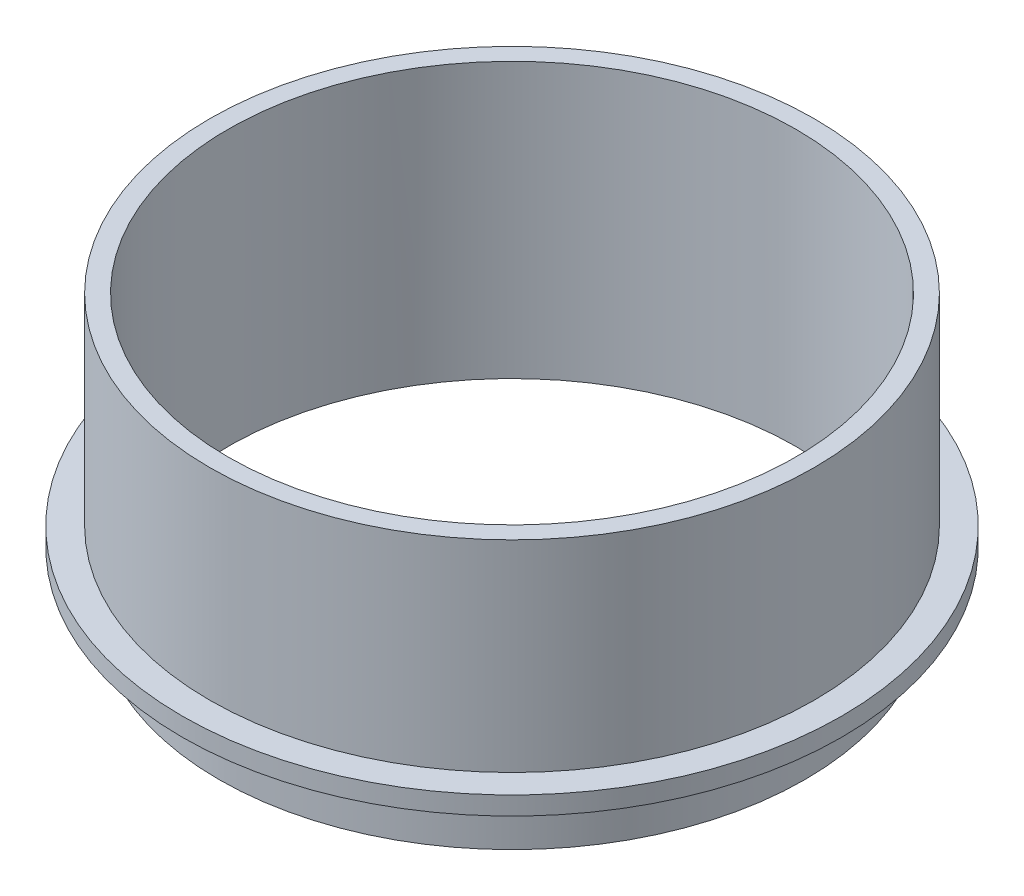
ISO-10303-21;
HEADER;
FILE_DESCRIPTION(('STEP AP214'),'2;1');
FILE_NAME('part.step','',(''),(''),'','','');
FILE_SCHEMA(('AUTOMOTIVE_DESIGN { 1 0 10303 214 1 1 1 1 }'));
ENDSEC;
DATA;
#1=APPLICATION_CONTEXT('core data for automotive mechanical design processes');
#2=APPLICATION_PROTOCOL_DEFINITION('international standard','automotive_design',2000,#1);
#3=PRODUCT_CONTEXT('',#1,'mechanical');
#4=PRODUCT('Part','Part','',(#3));
#5=PRODUCT_RELATED_PRODUCT_CATEGORY('part','',(#4));
#6=PRODUCT_DEFINITION_FORMATION('','',#4);
#7=PRODUCT_DEFINITION_CONTEXT('part definition',#1,'design');
#8=PRODUCT_DEFINITION('design','',#6,#7);
#9=PRODUCT_DEFINITION_SHAPE('','',#8);
#10=(LENGTH_UNIT() NAMED_UNIT(*) SI_UNIT(.MILLI.,.METRE.));
#11=(NAMED_UNIT(*) PLANE_ANGLE_UNIT() SI_UNIT($,.RADIAN.));
#12=(NAMED_UNIT(*) SI_UNIT($,.STERADIAN.) SOLID_ANGLE_UNIT());
#13=UNCERTAINTY_MEASURE_WITH_UNIT(LENGTH_MEASURE(1.E-05),#10,'distance_accuracy_value','');
#14=(GEOMETRIC_REPRESENTATION_CONTEXT(3) GLOBAL_UNCERTAINTY_ASSIGNED_CONTEXT((#13)) GLOBAL_UNIT_ASSIGNED_CONTEXT((#10,
#11,#12)) REPRESENTATION_CONTEXT('',''));
#15=CARTESIAN_POINT('',(0.,0.,0.));
#16=DIRECTION('',(0.,0.,1.));
#17=DIRECTION('',(1.,0.,0.));
#18=AXIS2_PLACEMENT_3D('',#15,#16,#17);
#19=CARTESIAN_POINT('',(0.,38.1,0.));
#20=DIRECTION('',(0.,-1.,0.));
#21=DIRECTION('',(0.,0.,-1.));
#22=AXIS2_PLACEMENT_3D('',#19,#20,#21);
#23=CYLINDRICAL_SURFACE('',#22,52.3875);
#24=CARTESIAN_POINT('',(0.,38.1,0.));
#25=DIRECTION('',(0.,1.,0.));
#26=DIRECTION('',(0.,0.,1.));
#27=AXIS2_PLACEMENT_3D('',#24,#25,#26);
#28=CIRCLE('',#27,52.3875);
#29=CARTESIAN_POINT('',(0.,38.1,52.3875));
#30=VERTEX_POINT('',#29);
#31=EDGE_CURVE('E43',#30,#30,#28,.T.);
#32=ORIENTED_EDGE('',*,*,#31,.F.);
#33=EDGE_LOOP('',(#32));
#34=FACE_BOUND('',#33,.T.);
#35=CARTESIAN_POINT('',(0.,3.175,0.));
#36=DIRECTION('',(0.,-1.,0.));
#37=DIRECTION('',(0.,0.,-1.));
#38=AXIS2_PLACEMENT_3D('',#35,#36,#37);
#39=CIRCLE('',#38,52.3875);
#40=CARTESIAN_POINT('',(0.,3.175,-52.3875));
#41=VERTEX_POINT('',#40);
#42=EDGE_CURVE('E10',#41,#41,#39,.T.);
#43=ORIENTED_EDGE('',*,*,#42,.F.);
#44=EDGE_LOOP('',(#43));
#45=FACE_BOUND('',#44,.T.);
#46=ADVANCED_FACE('F32',(#34,#45),#23,.T.);
#47=CARTESIAN_POINT('',(0.,38.1,0.));
#48=DIRECTION('',(0.,-1.,0.));
#49=DIRECTION('',(0.,0.,-1.));
#50=AXIS2_PLACEMENT_3D('',#47,#48,#49);
#51=CYLINDRICAL_SURFACE('',#50,49.2125);
#52=CARTESIAN_POINT('',(0.,38.1,0.));
#53=DIRECTION('',(0.,1.,0.));
#54=DIRECTION('',(0.,0.,1.));
#55=AXIS2_PLACEMENT_3D('',#52,#53,#54);
#56=CIRCLE('',#55,49.2125);
#57=CARTESIAN_POINT('',(0.,38.1,49.2125));
#58=VERTEX_POINT('',#57);
#59=EDGE_CURVE('E47',#58,#58,#56,.T.);
#60=ORIENTED_EDGE('',*,*,#59,.T.);
#61=EDGE_LOOP('',(#60));
#62=FACE_BOUND('',#61,.T.);
#63=CARTESIAN_POINT('',(0.,-9.525,0.));
#64=DIRECTION('',(0.,-1.,0.));
#65=DIRECTION('',(0.,0.,-1.));
#66=AXIS2_PLACEMENT_3D('',#63,#64,#65);
#67=CIRCLE('',#66,49.2125);
#68=CARTESIAN_POINT('',(0.,-9.525,-49.2125));
#69=VERTEX_POINT('',#68);
#70=EDGE_CURVE('E55',#69,#69,#67,.F.);
#71=ORIENTED_EDGE('',*,*,#70,.F.);
#72=EDGE_LOOP('',(#71));
#73=FACE_BOUND('',#72,.T.);
#74=ADVANCED_FACE('F34',(#62,#73),#51,.F.);
#75=CARTESIAN_POINT('',(0.,38.1,0.));
#76=DIRECTION('',(0.,1.,0.));
#77=DIRECTION('',(0.,0.,1.));
#78=AXIS2_PLACEMENT_3D('',#75,#76,#77);
#79=PLANE('',#78);
#80=ORIENTED_EDGE('',*,*,#59,.F.);
#81=EDGE_LOOP('',(#80));
#82=FACE_BOUND('',#81,.T.);
#83=ORIENTED_EDGE('',*,*,#31,.T.);
#84=EDGE_LOOP('',(#83));
#85=FACE_BOUND('',#84,.T.);
#86=ADVANCED_FACE('F81',(#82,#85),#79,.T.);
#87=CARTESIAN_POINT('',(0.,0.,0.));
#88=DIRECTION('',(0.,1.,0.));
#89=DIRECTION('',(0.,0.,1.));
#90=AXIS2_PLACEMENT_3D('',#87,#88,#89);
#91=PLANE('',#90);
#92=CARTESIAN_POINT('',(0.,0.,0.));
#93=DIRECTION('',(0.,1.,0.));
#94=DIRECTION('',(0.,0.,1.));
#95=AXIS2_PLACEMENT_3D('',#92,#93,#94);
#96=CIRCLE('',#95,50.8);
#97=CARTESIAN_POINT('',(0.,0.,50.8));
#98=VERTEX_POINT('',#97);
#99=EDGE_CURVE('E39',#98,#98,#96,.F.);
#100=ORIENTED_EDGE('',*,*,#99,.F.);
#101=EDGE_LOOP('',(#100));
#102=FACE_BOUND('',#101,.T.);
#103=CARTESIAN_POINT('',(0.,0.,0.));
#104=DIRECTION('',(0.,-1.,0.));
#105=DIRECTION('',(0.,0.,-1.));
#106=AXIS2_PLACEMENT_3D('',#103,#104,#105);
#107=CIRCLE('',#106,57.15);
#108=CARTESIAN_POINT('',(0.,0.,-57.15));
#109=VERTEX_POINT('',#108);
#110=EDGE_CURVE('E59',#109,#109,#107,.T.);
#111=ORIENTED_EDGE('',*,*,#110,.T.);
#112=EDGE_LOOP('',(#111));
#113=FACE_BOUND('',#112,.T.);
#114=ADVANCED_FACE('F86',(#102,#113),#91,.F.);
#115=CARTESIAN_POINT('',(0.,-9.525,0.));
#116=DIRECTION('',(0.,1.,0.));
#117=DIRECTION('',(0.,0.,1.));
#118=AXIS2_PLACEMENT_3D('',#115,#116,#117);
#119=CYLINDRICAL_SURFACE('',#118,50.8);
#120=CARTESIAN_POINT('',(0.,-9.525,0.));
#121=DIRECTION('',(0.,-1.,0.));
#122=DIRECTION('',(0.,0.,-1.));
#123=AXIS2_PLACEMENT_3D('',#120,#121,#122);
#124=CIRCLE('',#123,50.8);
#125=CARTESIAN_POINT('',(0.,-9.525,-50.8));
#126=VERTEX_POINT('',#125);
#127=EDGE_CURVE('E52',#126,#126,#124,.T.);
#128=ORIENTED_EDGE('',*,*,#127,.F.);
#129=EDGE_LOOP('',(#128));
#130=FACE_BOUND('',#129,.T.);
#131=ORIENTED_EDGE('',*,*,#99,.T.);
#132=EDGE_LOOP('',(#131));
#133=FACE_BOUND('',#132,.T.);
#134=ADVANCED_FACE('F89',(#130,#133),#119,.T.);
#135=CARTESIAN_POINT('',(0.,-9.525,0.));
#136=DIRECTION('',(0.,-1.,0.));
#137=DIRECTION('',(0.,0.,-1.));
#138=AXIS2_PLACEMENT_3D('',#135,#136,#137);
#139=PLANE('',#138);
#140=ORIENTED_EDGE('',*,*,#70,.T.);
#141=EDGE_LOOP('',(#140));
#142=FACE_BOUND('',#141,.T.);
#143=ORIENTED_EDGE('',*,*,#127,.T.);
#144=EDGE_LOOP('',(#143));
#145=FACE_BOUND('',#144,.T.);
#146=ADVANCED_FACE('F74',(#142,#145),#139,.T.);
#147=CARTESIAN_POINT('',(0.,3.175,0.));
#148=DIRECTION('',(0.,-1.,0.));
#149=DIRECTION('',(0.,0.,-1.));
#150=AXIS2_PLACEMENT_3D('',#147,#148,#149);
#151=CYLINDRICAL_SURFACE('',#150,57.15);
#152=CARTESIAN_POINT('',(0.,3.175,0.));
#153=DIRECTION('',(0.,-1.,0.));
#154=DIRECTION('',(0.,0.,-1.));
#155=AXIS2_PLACEMENT_3D('',#152,#153,#154);
#156=CIRCLE('',#155,57.15);
#157=CARTESIAN_POINT('',(0.,3.175,-57.15));
#158=VERTEX_POINT('',#157);
#159=EDGE_CURVE('E58',#158,#158,#156,.T.);
#160=ORIENTED_EDGE('',*,*,#159,.T.);
#161=EDGE_LOOP('',(#160));
#162=FACE_BOUND('',#161,.T.);
#163=ORIENTED_EDGE('',*,*,#110,.F.);
#164=EDGE_LOOP('',(#163));
#165=FACE_BOUND('',#164,.T.);
#166=ADVANCED_FACE('F65',(#162,#165),#151,.T.);
#167=CARTESIAN_POINT('',(0.,3.175,0.));
#168=DIRECTION('',(0.,-1.,0.));
#169=DIRECTION('',(0.,0.,-1.));
#170=AXIS2_PLACEMENT_3D('',#167,#168,#169);
#171=PLANE('',#170);
#172=ORIENTED_EDGE('',*,*,#42,.T.);
#173=EDGE_LOOP('',(#172));
#174=FACE_BOUND('',#173,.T.);
#175=ORIENTED_EDGE('',*,*,#159,.F.);
#176=EDGE_LOOP('',(#175));
#177=FACE_BOUND('',#176,.T.);
#178=ADVANCED_FACE('F68',(#174,#177),#171,.F.);
#179=CLOSED_SHELL('',(#46,#74,#86,#114,#134,#146,#166,#178));
#180=MANIFOLD_SOLID_BREP('B2',#179);
#181=ADVANCED_BREP_SHAPE_REPRESENTATION('',(#18,#180),#14);
#182=SHAPE_DEFINITION_REPRESENTATION(#9,#181);
ENDSEC;
END-ISO-10303-21;
